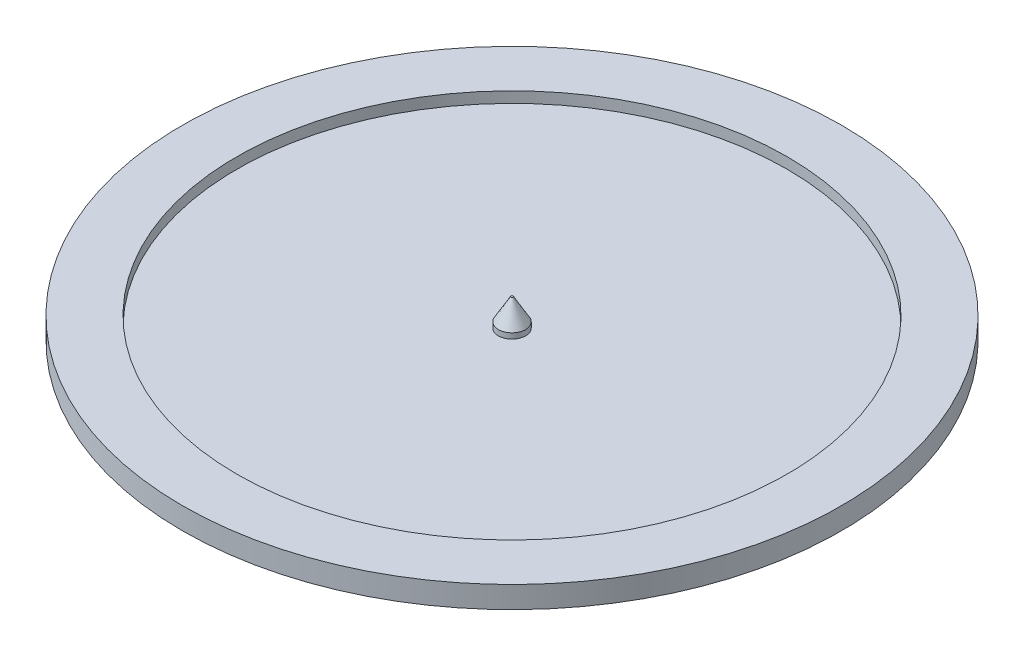
ISO-10303-21;
HEADER;
FILE_DESCRIPTION(('STEP AP214'),'2;1');
FILE_NAME('part.step','',(''),(''),'','','');
FILE_SCHEMA(('AUTOMOTIVE_DESIGN { 1 0 10303 214 1 1 1 1 }'));
ENDSEC;
DATA;
#1=APPLICATION_CONTEXT('core data for automotive mechanical design processes');
#2=APPLICATION_PROTOCOL_DEFINITION('international standard','automotive_design',2000,#1);
#3=PRODUCT_CONTEXT('',#1,'mechanical');
#4=PRODUCT('Part','Part','',(#3));
#5=PRODUCT_RELATED_PRODUCT_CATEGORY('part','',(#4));
#6=PRODUCT_DEFINITION_FORMATION('','',#4);
#7=PRODUCT_DEFINITION_CONTEXT('part definition',#1,'design');
#8=PRODUCT_DEFINITION('design','',#6,#7);
#9=PRODUCT_DEFINITION_SHAPE('','',#8);
#10=(LENGTH_UNIT() NAMED_UNIT(*) SI_UNIT(.MILLI.,.METRE.));
#11=(NAMED_UNIT(*) PLANE_ANGLE_UNIT() SI_UNIT($,.RADIAN.));
#12=(NAMED_UNIT(*) SI_UNIT($,.STERADIAN.) SOLID_ANGLE_UNIT());
#13=UNCERTAINTY_MEASURE_WITH_UNIT(LENGTH_MEASURE(1.E-05),#10,'distance_accuracy_value','');
#14=(GEOMETRIC_REPRESENTATION_CONTEXT(3) GLOBAL_UNCERTAINTY_ASSIGNED_CONTEXT((#13)) GLOBAL_UNIT_ASSIGNED_CONTEXT((#10,
#11,#12)) REPRESENTATION_CONTEXT('',''));
#15=CARTESIAN_POINT('',(0.,0.,0.));
#16=DIRECTION('',(0.,0.,1.));
#17=DIRECTION('',(1.,0.,0.));
#18=AXIS2_PLACEMENT_3D('',#15,#16,#17);
#19=CARTESIAN_POINT('',(0.,2.,0.));
#20=DIRECTION('',(0.,-1.,0.));
#21=DIRECTION('',(0.,0.,-1.));
#22=AXIS2_PLACEMENT_3D('',#19,#20,#21);
#23=CYLINDRICAL_SURFACE('',#22,60.5);
#24=CARTESIAN_POINT('',(0.,0.,0.));
#25=DIRECTION('',(0.,1.,0.));
#26=DIRECTION('',(0.,0.,1.));
#27=AXIS2_PLACEMENT_3D('',#24,#25,#26);
#28=CIRCLE('',#27,60.5);
#29=CARTESIAN_POINT('',(0.,0.,60.5));
#30=VERTEX_POINT('',#29);
#31=EDGE_CURVE('E62',#30,#30,#28,.T.);
#32=ORIENTED_EDGE('',*,*,#31,.T.);
#33=EDGE_LOOP('',(#32));
#34=FACE_BOUND('',#33,.T.);
#35=CARTESIAN_POINT('',(0.,4.,0.));
#36=DIRECTION('',(0.,1.,0.));
#37=DIRECTION('',(0.,0.,1.));
#38=AXIS2_PLACEMENT_3D('',#35,#36,#37);
#39=CIRCLE('',#38,60.5);
#40=CARTESIAN_POINT('',(0.,4.,60.5));
#41=VERTEX_POINT('',#40);
#42=EDGE_CURVE('E68',#41,#41,#39,.T.);
#43=ORIENTED_EDGE('',*,*,#42,.F.);
#44=EDGE_LOOP('',(#43));
#45=FACE_BOUND('',#44,.T.);
#46=ADVANCED_FACE('F43',(#34,#45),#23,.T.);
#47=CARTESIAN_POINT('',(0.,0.,0.));
#48=DIRECTION('',(0.,1.,0.));
#49=DIRECTION('',(0.,0.,1.));
#50=AXIS2_PLACEMENT_3D('',#47,#48,#49);
#51=PLANE('',#50);
#52=ORIENTED_EDGE('',*,*,#31,.F.);
#53=EDGE_LOOP('',(#52));
#54=FACE_BOUND('',#53,.T.);
#55=ADVANCED_FACE('F97',(#54),#51,.F.);
#56=CARTESIAN_POINT('',(0.,4.,0.));
#57=DIRECTION('',(0.,1.,0.));
#58=DIRECTION('',(0.,0.,1.));
#59=AXIS2_PLACEMENT_3D('',#56,#57,#58);
#60=PLANE('',#59);
#61=ORIENTED_EDGE('',*,*,#42,.T.);
#62=EDGE_LOOP('',(#61));
#63=FACE_BOUND('',#62,.T.);
#64=CARTESIAN_POINT('',(0.,4.,0.));
#65=DIRECTION('',(0.,1.,0.));
#66=DIRECTION('',(0.,0.,1.));
#67=AXIS2_PLACEMENT_3D('',#64,#65,#66);
#68=CIRCLE('',#67,50.5);
#69=CARTESIAN_POINT('',(0.,4.,50.5));
#70=VERTEX_POINT('',#69);
#71=EDGE_CURVE('E72',#70,#70,#68,.T.);
#72=ORIENTED_EDGE('',*,*,#71,.F.);
#73=EDGE_LOOP('',(#72));
#74=FACE_BOUND('',#73,.T.);
#75=ADVANCED_FACE('F91',(#63,#74),#60,.T.);
#76=CARTESIAN_POINT('',(0.,4.,0.));
#77=DIRECTION('',(0.,-1.,0.));
#78=DIRECTION('',(0.,0.,-1.));
#79=AXIS2_PLACEMENT_3D('',#76,#77,#78);
#80=CYLINDRICAL_SURFACE('',#79,50.5);
#81=ORIENTED_EDGE('',*,*,#71,.T.);
#82=EDGE_LOOP('',(#81));
#83=FACE_BOUND('',#82,.T.);
#84=CARTESIAN_POINT('',(0.,2.,0.));
#85=DIRECTION('',(0.,1.,0.));
#86=DIRECTION('',(0.,0.,1.));
#87=AXIS2_PLACEMENT_3D('',#84,#85,#86);
#88=CIRCLE('',#87,50.5);
#89=CARTESIAN_POINT('',(0.,2.,50.5));
#90=VERTEX_POINT('',#89);
#91=EDGE_CURVE('E57',#90,#90,#88,.F.);
#92=ORIENTED_EDGE('',*,*,#91,.T.);
#93=EDGE_LOOP('',(#92));
#94=FACE_BOUND('',#93,.T.);
#95=ADVANCED_FACE('F86',(#83,#94),#80,.F.);
#96=CARTESIAN_POINT('',(0.,2.,0.));
#97=DIRECTION('',(0.,1.,0.));
#98=DIRECTION('',(0.,0.,1.));
#99=AXIS2_PLACEMENT_3D('',#96,#97,#98);
#100=PLANE('',#99);
#101=CARTESIAN_POINT('',(0.,2.,0.));
#102=DIRECTION('',(0.,1.,0.));
#103=DIRECTION('',(0.,0.,1.));
#104=AXIS2_PLACEMENT_3D('',#101,#102,#103);
#105=CIRCLE('',#104,2.5);
#106=CARTESIAN_POINT('',(0.,2.,2.5));
#107=VERTEX_POINT('',#106);
#108=EDGE_CURVE('E76',#107,#107,#105,.T.);
#109=ORIENTED_EDGE('',*,*,#108,.F.);
#110=EDGE_LOOP('',(#109));
#111=FACE_BOUND('',#110,.T.);
#112=ORIENTED_EDGE('',*,*,#91,.F.);
#113=EDGE_LOOP('',(#112));
#114=FACE_BOUND('',#113,.T.);
#115=ADVANCED_FACE('F83',(#111,#114),#100,.T.);
#116=CARTESIAN_POINT('',(0.,7.,0.));
#117=DIRECTION('',(0.,-1.,0.));
#118=DIRECTION('',(0.,0.,-1.));
#119=AXIS2_PLACEMENT_3D('',#116,#117,#118);
#120=CYLINDRICAL_SURFACE('',#119,2.5);
#121=CARTESIAN_POINT('',(0.,2.99999999999994,0.));
#122=DIRECTION('',(0.,1.,0.));
#123=DIRECTION('',(0.,0.,1.));
#124=AXIS2_PLACEMENT_3D('',#121,#122,#123);
#125=CIRCLE('',#124,2.5);
#126=CARTESIAN_POINT('',(0.,2.99999999999994,2.5));
#127=VERTEX_POINT('',#126);
#128=EDGE_CURVE('E10',#127,#127,#125,.F.);
#129=ORIENTED_EDGE('',*,*,#128,.T.);
#130=EDGE_LOOP('',(#129));
#131=FACE_BOUND('',#130,.T.);
#132=ORIENTED_EDGE('',*,*,#108,.T.);
#133=EDGE_LOOP('',(#132));
#134=FACE_BOUND('',#133,.T.);
#135=ADVANCED_FACE('F81',(#131,#134),#120,.T.);
#136=CARTESIAN_POINT('',(0.,7.,0.));
#137=DIRECTION('',(0.,1.,0.));
#138=DIRECTION('',(0.,0.,1.));
#139=AXIS2_PLACEMENT_3D('',#136,#137,#138);
#140=PLANE('',#139);
#141=CARTESIAN_POINT('',(0.,7.,0.));
#142=DIRECTION('',(0.,1.,0.));
#143=DIRECTION('',(0.,0.,1.));
#144=AXIS2_PLACEMENT_3D('',#141,#142,#143);
#145=CIRCLE('',#144,0.190598923241483);
#146=CARTESIAN_POINT('',(0.,7.,0.190598923241483));
#147=VERTEX_POINT('',#146);
#148=EDGE_CURVE('E52',#147,#147,#145,.T.);
#149=ORIENTED_EDGE('',*,*,#148,.T.);
#150=EDGE_LOOP('',(#149));
#151=FACE_BOUND('',#150,.T.);
#152=ADVANCED_FACE('F143',(#151),#140,.T.);
#153=CARTESIAN_POINT('',(0.,7.,0.));
#154=DIRECTION('',(0.,-1.,0.));
#155=DIRECTION('',(0.,0.,-1.));
#156=AXIS2_PLACEMENT_3D('',#153,#154,#155);
#157=CONICAL_SURFACE('',#156,0.190598923241483,0.523598775598295);
#158=ORIENTED_EDGE('',*,*,#128,.F.);
#159=EDGE_LOOP('',(#158));
#160=FACE_BOUND('',#159,.T.);
#161=ORIENTED_EDGE('',*,*,#148,.F.);
#162=EDGE_LOOP('',(#161));
#163=FACE_BOUND('',#162,.T.);
#164=ADVANCED_FACE('F46',(#160,#163),#157,.T.);
#165=CLOSED_SHELL('',(#46,#55,#75,#95,#115,#135,#152,#164));
#166=MANIFOLD_SOLID_BREP('B2',#165);
#167=ADVANCED_BREP_SHAPE_REPRESENTATION('',(#18,#166),#14);
#168=SHAPE_DEFINITION_REPRESENTATION(#9,#167);
ENDSEC;
END-ISO-10303-21;
